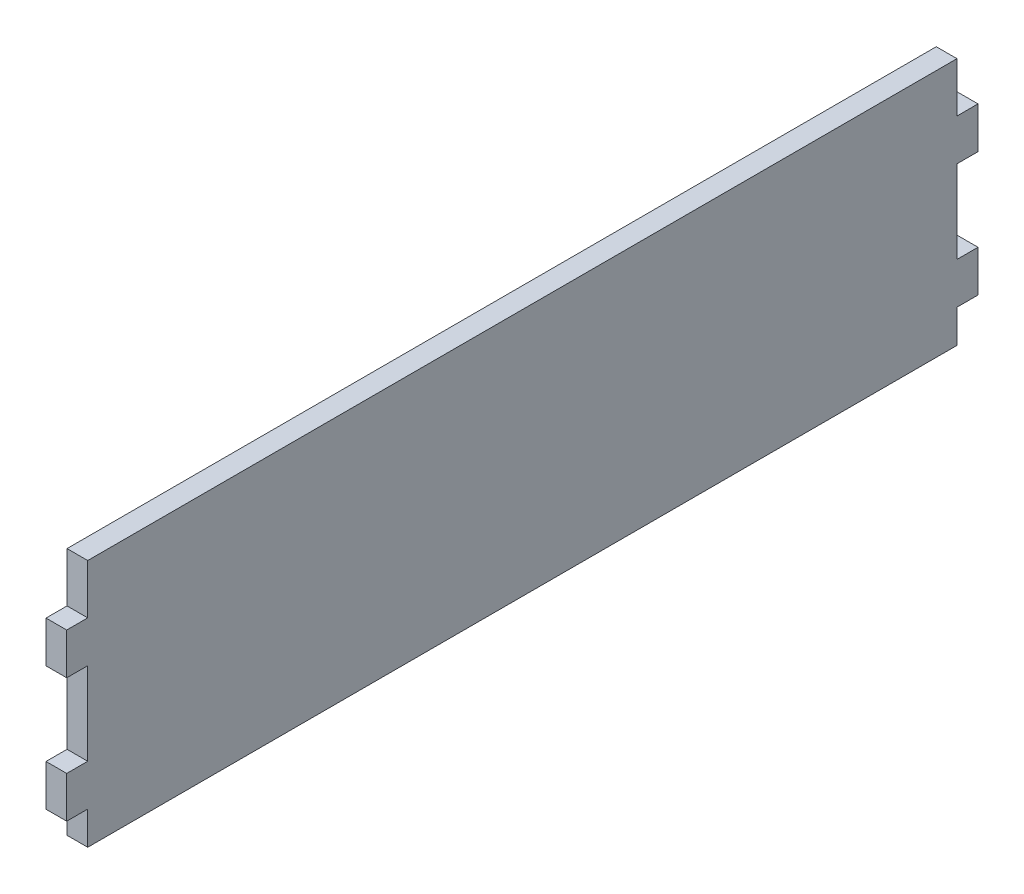
ISO-10303-21;
HEADER;
FILE_DESCRIPTION(('STEP AP214'),'2;1');
FILE_NAME('part.step','',(''),(''),'','','');
FILE_SCHEMA(('AUTOMOTIVE_DESIGN { 1 0 10303 214 1 1 1 1 }'));
ENDSEC;
DATA;
#1=APPLICATION_CONTEXT('core data for automotive mechanical design processes');
#2=APPLICATION_PROTOCOL_DEFINITION('international standard','automotive_design',2000,#1);
#3=PRODUCT_CONTEXT('',#1,'mechanical');
#4=PRODUCT('Part','Part','',(#3));
#5=PRODUCT_RELATED_PRODUCT_CATEGORY('part','',(#4));
#6=PRODUCT_DEFINITION_FORMATION('','',#4);
#7=PRODUCT_DEFINITION_CONTEXT('part definition',#1,'design');
#8=PRODUCT_DEFINITION('design','',#6,#7);
#9=PRODUCT_DEFINITION_SHAPE('','',#8);
#10=(LENGTH_UNIT() NAMED_UNIT(*) SI_UNIT(.MILLI.,.METRE.));
#11=(NAMED_UNIT(*) PLANE_ANGLE_UNIT() SI_UNIT($,.RADIAN.));
#12=(NAMED_UNIT(*) SI_UNIT($,.STERADIAN.) SOLID_ANGLE_UNIT());
#13=UNCERTAINTY_MEASURE_WITH_UNIT(LENGTH_MEASURE(1.E-05),#10,'distance_accuracy_value','');
#14=(GEOMETRIC_REPRESENTATION_CONTEXT(3) GLOBAL_UNCERTAINTY_ASSIGNED_CONTEXT((#13)) GLOBAL_UNIT_ASSIGNED_CONTEXT((#10,
#11,#12)) REPRESENTATION_CONTEXT('',''));
#15=CARTESIAN_POINT('',(0.,0.,0.));
#16=DIRECTION('',(0.,0.,1.));
#17=DIRECTION('',(1.,0.,0.));
#18=AXIS2_PLACEMENT_3D('',#15,#16,#17);
#19=CARTESIAN_POINT('',(3.175,-19.05,66.675));
#20=DIRECTION('',(0.,0.,-1.));
#21=DIRECTION('',(-1.,0.,0.));
#22=AXIS2_PLACEMENT_3D('',#19,#20,#21);
#23=PLANE('',#22);
#24=DIRECTION('',(-1.,0.,0.));
#25=VECTOR('',#24,1.);
#26=CARTESIAN_POINT('',(3.175,-7.62,66.675));
#27=LINE('',#26,#25);
#28=CARTESIAN_POINT('',(3.175,-7.62,66.675));
#29=VERTEX_POINT('',#28);
#30=CARTESIAN_POINT('',(0.,-7.62,66.675));
#31=VERTEX_POINT('',#30);
#32=EDGE_CURVE('E57',#29,#31,#27,.T.);
#33=ORIENTED_EDGE('',*,*,#32,.F.);
#34=DIRECTION('',(0.,-1.,0.));
#35=VECTOR('',#34,1.);
#36=CARTESIAN_POINT('',(3.175,-19.05,66.675));
#37=LINE('',#36,#35);
#38=CARTESIAN_POINT('',(3.175,5.08,66.675));
#39=VERTEX_POINT('',#38);
#40=EDGE_CURVE('E282',#39,#29,#37,.T.);
#41=ORIENTED_EDGE('',*,*,#40,.F.);
#42=DIRECTION('',(-1.,0.,0.));
#43=VECTOR('',#42,1.);
#44=CARTESIAN_POINT('',(3.175,5.08,66.675));
#45=LINE('',#44,#43);
#46=CARTESIAN_POINT('',(0.,5.07999999999999,66.675));
#47=VERTEX_POINT('',#46);
#48=EDGE_CURVE('E306',#39,#47,#45,.T.);
#49=ORIENTED_EDGE('',*,*,#48,.T.);
#50=DIRECTION('',(0.,-1.,0.));
#51=VECTOR('',#50,1.);
#52=CARTESIAN_POINT('',(0.,-19.05,66.675));
#53=LINE('',#52,#51);
#54=EDGE_CURVE('E232',#47,#31,#53,.T.);
#55=ORIENTED_EDGE('',*,*,#54,.T.);
#56=EDGE_LOOP('',(#33,#41,#49,#55));
#57=FACE_BOUND('',#56,.T.);
#58=ADVANCED_FACE('F32',(#57),#23,.F.);
#59=DIRECTION('',(-1.,0.,0.));
#60=VECTOR('',#59,1.);
#61=CARTESIAN_POINT('',(3.175,-13.97,66.675));
#62=LINE('',#61,#60);
#63=CARTESIAN_POINT('',(3.175,-13.97,66.675));
#64=VERTEX_POINT('',#63);
#65=CARTESIAN_POINT('',(0.,-13.97,66.675));
#66=VERTEX_POINT('',#65);
#67=EDGE_CURVE('E194',#64,#66,#62,.T.);
#68=ORIENTED_EDGE('',*,*,#67,.T.);
#69=CARTESIAN_POINT('',(0.,-19.05,66.675));
#70=VERTEX_POINT('',#69);
#71=EDGE_CURVE('E230',#66,#70,#53,.T.);
#72=ORIENTED_EDGE('',*,*,#71,.T.);
#73=DIRECTION('',(-1.,0.,0.));
#74=VECTOR('',#73,1.);
#75=CARTESIAN_POINT('',(3.175,-19.05,66.675));
#76=LINE('',#75,#74);
#77=CARTESIAN_POINT('',(3.175,-19.05,66.675));
#78=VERTEX_POINT('',#77);
#79=EDGE_CURVE('E297',#78,#70,#76,.T.);
#80=ORIENTED_EDGE('',*,*,#79,.F.);
#81=EDGE_CURVE('E36',#64,#78,#37,.T.);
#82=ORIENTED_EDGE('',*,*,#81,.F.);
#83=EDGE_LOOP('',(#68,#72,#80,#82));
#84=FACE_BOUND('',#83,.T.);
#85=ADVANCED_FACE('F426',(#84),#23,.F.);
#86=DIRECTION('',(-1.,0.,0.));
#87=VECTOR('',#86,1.);
#88=CARTESIAN_POINT('',(3.175,11.43,66.675));
#89=LINE('',#88,#87);
#90=CARTESIAN_POINT('',(3.175,11.43,66.675));
#91=VERTEX_POINT('',#90);
#92=CARTESIAN_POINT('',(0.,11.43,66.675));
#93=VERTEX_POINT('',#92);
#94=EDGE_CURVE('E221',#91,#93,#89,.T.);
#95=ORIENTED_EDGE('',*,*,#94,.F.);
#96=CARTESIAN_POINT('',(3.175,19.05,66.675));
#97=VERTEX_POINT('',#96);
#98=EDGE_CURVE('E277',#97,#91,#37,.T.);
#99=ORIENTED_EDGE('',*,*,#98,.F.);
#100=DIRECTION('',(-1.,0.,0.));
#101=VECTOR('',#100,1.);
#102=CARTESIAN_POINT('',(3.175,19.05,66.675));
#103=LINE('',#102,#101);
#104=CARTESIAN_POINT('',(0.,19.05,66.675));
#105=VERTEX_POINT('',#104);
#106=EDGE_CURVE('E42',#97,#105,#103,.T.);
#107=ORIENTED_EDGE('',*,*,#106,.T.);
#108=EDGE_CURVE('E245',#105,#93,#53,.T.);
#109=ORIENTED_EDGE('',*,*,#108,.T.);
#110=EDGE_LOOP('',(#95,#99,#107,#109));
#111=FACE_BOUND('',#110,.T.);
#112=ADVANCED_FACE('F300',(#111),#23,.F.);
#113=CARTESIAN_POINT('',(3.175,-19.05,-66.675));
#114=DIRECTION('',(0.,0.,1.));
#115=DIRECTION('',(1.,0.,0.));
#116=AXIS2_PLACEMENT_3D('',#113,#114,#115);
#117=PLANE('',#116);
#118=DIRECTION('',(0.,1.,0.));
#119=VECTOR('',#118,1.);
#120=CARTESIAN_POINT('',(0.,-19.05,-66.675));
#121=LINE('',#120,#119);
#122=CARTESIAN_POINT('',(0.,-19.05,-66.675));
#123=VERTEX_POINT('',#122);
#124=CARTESIAN_POINT('',(0.,-13.97,-66.675));
#125=VERTEX_POINT('',#124);
#126=EDGE_CURVE('E270',#123,#125,#121,.T.);
#127=ORIENTED_EDGE('',*,*,#126,.T.);
#128=DIRECTION('',(-1.,0.,0.));
#129=VECTOR('',#128,1.);
#130=CARTESIAN_POINT('',(3.175,-13.97,-66.675));
#131=LINE('',#130,#129);
#132=CARTESIAN_POINT('',(3.175,-13.97,-66.675));
#133=VERTEX_POINT('',#132);
#134=EDGE_CURVE('E336',#133,#125,#131,.T.);
#135=ORIENTED_EDGE('',*,*,#134,.F.);
#136=DIRECTION('',(0.,1.,0.));
#137=VECTOR('',#136,1.);
#138=CARTESIAN_POINT('',(3.175,-19.05,-66.675));
#139=LINE('',#138,#137);
#140=CARTESIAN_POINT('',(3.175,-19.05,-66.675));
#141=VERTEX_POINT('',#140);
#142=EDGE_CURVE('E251',#141,#133,#139,.T.);
#143=ORIENTED_EDGE('',*,*,#142,.F.);
#144=DIRECTION('',(-1.,0.,0.));
#145=VECTOR('',#144,1.);
#146=CARTESIAN_POINT('',(3.175,-19.05,-66.675));
#147=LINE('',#146,#145);
#148=EDGE_CURVE('E276',#141,#123,#147,.T.);
#149=ORIENTED_EDGE('',*,*,#148,.T.);
#150=EDGE_LOOP('',(#127,#135,#143,#149));
#151=FACE_BOUND('',#150,.T.);
#152=ADVANCED_FACE('F396',(#151),#117,.F.);
#153=CARTESIAN_POINT('',(3.175,-7.62,-66.675));
#154=VERTEX_POINT('',#153);
#155=CARTESIAN_POINT('',(3.175,5.08,-66.675));
#156=VERTEX_POINT('',#155);
#157=EDGE_CURVE('E248',#154,#156,#139,.T.);
#158=ORIENTED_EDGE('',*,*,#157,.F.);
#159=DIRECTION('',(-1.,0.,0.));
#160=VECTOR('',#159,1.);
#161=CARTESIAN_POINT('',(3.175,-7.62,-66.675));
#162=LINE('',#161,#160);
#163=CARTESIAN_POINT('',(0.,-7.62,-66.675));
#164=VERTEX_POINT('',#163);
#165=EDGE_CURVE('E328',#154,#164,#162,.T.);
#166=ORIENTED_EDGE('',*,*,#165,.T.);
#167=CARTESIAN_POINT('',(0.,5.08,-66.675));
#168=VERTEX_POINT('',#167);
#169=EDGE_CURVE('E253',#164,#168,#121,.T.);
#170=ORIENTED_EDGE('',*,*,#169,.T.);
#171=DIRECTION('',(-1.,0.,0.));
#172=VECTOR('',#171,1.);
#173=CARTESIAN_POINT('',(3.175,5.08,-66.675));
#174=LINE('',#173,#172);
#175=EDGE_CURVE('E269',#156,#168,#174,.T.);
#176=ORIENTED_EDGE('',*,*,#175,.F.);
#177=EDGE_LOOP('',(#158,#166,#170,#176));
#178=FACE_BOUND('',#177,.T.);
#179=ADVANCED_FACE('F400',(#178),#117,.F.);
#180=CARTESIAN_POINT('',(3.175,11.43,-66.675));
#181=VERTEX_POINT('',#180);
#182=CARTESIAN_POINT('',(3.175,19.05,-66.675));
#183=VERTEX_POINT('',#182);
#184=EDGE_CURVE('E252',#181,#183,#139,.T.);
#185=ORIENTED_EDGE('',*,*,#184,.F.);
#186=DIRECTION('',(-1.,0.,0.));
#187=VECTOR('',#186,1.);
#188=CARTESIAN_POINT('',(3.175,11.43,-66.675));
#189=LINE('',#188,#187);
#190=CARTESIAN_POINT('',(0.,11.43,-66.675));
#191=VERTEX_POINT('',#190);
#192=EDGE_CURVE('E366',#181,#191,#189,.T.);
#193=ORIENTED_EDGE('',*,*,#192,.T.);
#194=CARTESIAN_POINT('',(0.,19.05,-66.675));
#195=VERTEX_POINT('',#194);
#196=EDGE_CURVE('E267',#191,#195,#121,.T.);
#197=ORIENTED_EDGE('',*,*,#196,.T.);
#198=DIRECTION('',(-1.,0.,0.));
#199=VECTOR('',#198,1.);
#200=CARTESIAN_POINT('',(3.175,19.05,-66.675));
#201=LINE('',#200,#199);
#202=EDGE_CURVE('E11',#183,#195,#201,.T.);
#203=ORIENTED_EDGE('',*,*,#202,.F.);
#204=EDGE_LOOP('',(#185,#193,#197,#203));
#205=FACE_BOUND('',#204,.T.);
#206=ADVANCED_FACE('F34',(#205),#117,.F.);
#207=CARTESIAN_POINT('',(3.175,19.05,66.675));
#208=DIRECTION('',(0.,-1.,0.));
#209=DIRECTION('',(0.,0.,-1.));
#210=AXIS2_PLACEMENT_3D('',#207,#208,#209);
#211=PLANE('',#210);
#212=DIRECTION('',(0.,0.,1.));
#213=VECTOR('',#212,1.);
#214=CARTESIAN_POINT('',(0.,19.05,66.675));
#215=LINE('',#214,#213);
#216=EDGE_CURVE('E233',#195,#105,#215,.T.);
#217=ORIENTED_EDGE('',*,*,#216,.T.);
#218=ORIENTED_EDGE('',*,*,#106,.F.);
#219=DIRECTION('',(0.,0.,1.));
#220=VECTOR('',#219,1.);
#221=CARTESIAN_POINT('',(3.175,19.05,66.675));
#222=LINE('',#221,#220);
#223=EDGE_CURVE('E260',#183,#97,#222,.T.);
#224=ORIENTED_EDGE('',*,*,#223,.F.);
#225=ORIENTED_EDGE('',*,*,#202,.T.);
#226=EDGE_LOOP('',(#217,#218,#224,#225));
#227=FACE_BOUND('',#226,.T.);
#228=ADVANCED_FACE('F293',(#227),#211,.F.);
#229=CARTESIAN_POINT('',(3.175,-19.05,66.675));
#230=DIRECTION('',(0.,1.,0.));
#231=DIRECTION('',(0.,0.,1.));
#232=AXIS2_PLACEMENT_3D('',#229,#230,#231);
#233=PLANE('',#232);
#234=DIRECTION('',(0.,0.,-1.));
#235=VECTOR('',#234,1.);
#236=CARTESIAN_POINT('',(0.,-19.05,66.675));
#237=LINE('',#236,#235);
#238=EDGE_CURVE('E238',#70,#123,#237,.T.);
#239=ORIENTED_EDGE('',*,*,#238,.T.);
#240=ORIENTED_EDGE('',*,*,#148,.F.);
#241=DIRECTION('',(0.,0.,-1.));
#242=VECTOR('',#241,1.);
#243=CARTESIAN_POINT('',(3.175,-19.05,66.675));
#244=LINE('',#243,#242);
#245=EDGE_CURVE('E273',#78,#141,#244,.T.);
#246=ORIENTED_EDGE('',*,*,#245,.F.);
#247=ORIENTED_EDGE('',*,*,#79,.T.);
#248=EDGE_LOOP('',(#239,#240,#246,#247));
#249=FACE_BOUND('',#248,.T.);
#250=ADVANCED_FACE('F392',(#249),#233,.F.);
#251=CARTESIAN_POINT('',(3.175,19.05,-66.675));
#252=DIRECTION('',(-1.,0.,0.));
#253=DIRECTION('',(0.,0.,1.));
#254=AXIS2_PLACEMENT_3D('',#251,#252,#253);
#255=PLANE('',#254);
#256=ORIENTED_EDGE('',*,*,#142,.T.);
#257=DIRECTION('',(0.,0.,1.));
#258=VECTOR('',#257,1.);
#259=CARTESIAN_POINT('',(3.175,-13.97,-69.9008));
#260=LINE('',#259,#258);
#261=CARTESIAN_POINT('',(3.175,-13.97,-69.9008));
#262=VERTEX_POINT('',#261);
#263=EDGE_CURVE('E325',#262,#133,#260,.T.);
#264=ORIENTED_EDGE('',*,*,#263,.F.);
#265=DIRECTION('',(0.,-1.,0.));
#266=VECTOR('',#265,1.);
#267=CARTESIAN_POINT('',(3.175,-7.62,-69.9008));
#268=LINE('',#267,#266);
#269=CARTESIAN_POINT('',(3.175,-7.62,-69.9008));
#270=VERTEX_POINT('',#269);
#271=EDGE_CURVE('E321',#270,#262,#268,.T.);
#272=ORIENTED_EDGE('',*,*,#271,.F.);
#273=DIRECTION('',(0.,0.,-1.));
#274=VECTOR('',#273,1.);
#275=CARTESIAN_POINT('',(3.175,-7.62,-66.675));
#276=LINE('',#275,#274);
#277=EDGE_CURVE('E318',#154,#270,#276,.T.);
#278=ORIENTED_EDGE('',*,*,#277,.F.);
#279=ORIENTED_EDGE('',*,*,#157,.T.);
#280=DIRECTION('',(0.,0.,1.));
#281=VECTOR('',#280,1.);
#282=CARTESIAN_POINT('',(3.175,5.08,-69.9008));
#283=LINE('',#282,#281);
#284=CARTESIAN_POINT('',(3.175,5.08,-69.9008));
#285=VERTEX_POINT('',#284);
#286=EDGE_CURVE('E349',#285,#156,#283,.T.);
#287=ORIENTED_EDGE('',*,*,#286,.F.);
#288=DIRECTION('',(0.,-1.,0.));
#289=VECTOR('',#288,1.);
#290=CARTESIAN_POINT('',(3.175,11.43,-69.9008));
#291=LINE('',#290,#289);
#292=CARTESIAN_POINT('',(3.175,11.43,-69.9008));
#293=VERTEX_POINT('',#292);
#294=EDGE_CURVE('E346',#293,#285,#291,.T.);
#295=ORIENTED_EDGE('',*,*,#294,.F.);
#296=DIRECTION('',(0.,0.,-1.));
#297=VECTOR('',#296,1.);
#298=CARTESIAN_POINT('',(3.175,11.43,-66.675));
#299=LINE('',#298,#297);
#300=EDGE_CURVE('E350',#181,#293,#299,.T.);
#301=ORIENTED_EDGE('',*,*,#300,.F.);
#302=ORIENTED_EDGE('',*,*,#184,.T.);
#303=ORIENTED_EDGE('',*,*,#223,.T.);
#304=ORIENTED_EDGE('',*,*,#98,.T.);
#305=DIRECTION('',(0.,0.,1.));
#306=VECTOR('',#305,1.);
#307=CARTESIAN_POINT('',(3.175,11.43,66.675));
#308=LINE('',#307,#306);
#309=CARTESIAN_POINT('',(3.175,11.43,69.9008));
#310=VERTEX_POINT('',#309);
#311=EDGE_CURVE('E211',#91,#310,#308,.T.);
#312=ORIENTED_EDGE('',*,*,#311,.T.);
#313=DIRECTION('',(0.,-1.,0.));
#314=VECTOR('',#313,1.);
#315=CARTESIAN_POINT('',(3.175,11.43,69.9008));
#316=LINE('',#315,#314);
#317=CARTESIAN_POINT('',(3.175,5.08,69.9008));
#318=VERTEX_POINT('',#317);
#319=EDGE_CURVE('E209',#310,#318,#316,.T.);
#320=ORIENTED_EDGE('',*,*,#319,.T.);
#321=DIRECTION('',(0.,0.,-1.));
#322=VECTOR('',#321,1.);
#323=CARTESIAN_POINT('',(3.175,5.08,69.9008));
#324=LINE('',#323,#322);
#325=EDGE_CURVE('E212',#318,#39,#324,.T.);
#326=ORIENTED_EDGE('',*,*,#325,.T.);
#327=ORIENTED_EDGE('',*,*,#40,.T.);
#328=DIRECTION('',(0.,0.,1.));
#329=VECTOR('',#328,1.);
#330=CARTESIAN_POINT('',(3.175,-7.62,66.675));
#331=LINE('',#330,#329);
#332=CARTESIAN_POINT('',(3.175,-7.62,69.9008));
#333=VERTEX_POINT('',#332);
#334=EDGE_CURVE('E180',#29,#333,#331,.T.);
#335=ORIENTED_EDGE('',*,*,#334,.T.);
#336=DIRECTION('',(0.,-1.,0.));
#337=VECTOR('',#336,1.);
#338=CARTESIAN_POINT('',(3.175,-7.62,69.9008));
#339=LINE('',#338,#337);
#340=CARTESIAN_POINT('',(3.175,-13.97,69.9008));
#341=VERTEX_POINT('',#340);
#342=EDGE_CURVE('E172',#333,#341,#339,.T.);
#343=ORIENTED_EDGE('',*,*,#342,.T.);
#344=DIRECTION('',(0.,0.,-1.));
#345=VECTOR('',#344,1.);
#346=CARTESIAN_POINT('',(3.175,-13.97,69.9008));
#347=LINE('',#346,#345);
#348=EDGE_CURVE('E177',#341,#64,#347,.T.);
#349=ORIENTED_EDGE('',*,*,#348,.T.);
#350=ORIENTED_EDGE('',*,*,#81,.T.);
#351=ORIENTED_EDGE('',*,*,#245,.T.);
#352=EDGE_LOOP('',(#256,#264,#272,#278,#279,#287,#295,#301,#302,#303,#304,#312,#320,#326,#327,
#335,#343,#349,#350,#351));
#353=FACE_BOUND('',#352,.T.);
#354=ADVANCED_FACE('F175',(#353),#255,.F.);
#355=CARTESIAN_POINT('',(0.,19.05,-66.675));
#356=DIRECTION('',(-1.,0.,0.));
#357=DIRECTION('',(0.,0.,1.));
#358=AXIS2_PLACEMENT_3D('',#355,#356,#357);
#359=PLANE('',#358);
#360=ORIENTED_EDGE('',*,*,#126,.F.);
#361=ORIENTED_EDGE('',*,*,#238,.F.);
#362=ORIENTED_EDGE('',*,*,#71,.F.);
#363=DIRECTION('',(0.,0.,-1.));
#364=VECTOR('',#363,1.);
#365=CARTESIAN_POINT('',(0.,-13.97,69.9008));
#366=LINE('',#365,#364);
#367=CARTESIAN_POINT('',(0.,-13.97,69.9008));
#368=VERTEX_POINT('',#367);
#369=EDGE_CURVE('E202',#368,#66,#366,.T.);
#370=ORIENTED_EDGE('',*,*,#369,.F.);
#371=DIRECTION('',(0.,-1.,0.));
#372=VECTOR('',#371,1.);
#373=CARTESIAN_POINT('',(0.,-7.62,69.9008));
#374=LINE('',#373,#372);
#375=CARTESIAN_POINT('',(0.,-7.62,69.9008));
#376=VERTEX_POINT('',#375);
#377=EDGE_CURVE('E189',#376,#368,#374,.T.);
#378=ORIENTED_EDGE('',*,*,#377,.F.);
#379=DIRECTION('',(0.,0.,1.));
#380=VECTOR('',#379,1.);
#381=CARTESIAN_POINT('',(0.,-7.62,66.675));
#382=LINE('',#381,#380);
#383=EDGE_CURVE('E197',#31,#376,#382,.T.);
#384=ORIENTED_EDGE('',*,*,#383,.F.);
#385=ORIENTED_EDGE('',*,*,#54,.F.);
#386=DIRECTION('',(0.,0.,-1.));
#387=VECTOR('',#386,1.);
#388=CARTESIAN_POINT('',(0.,5.08,69.9008));
#389=LINE('',#388,#387);
#390=CARTESIAN_POINT('',(0.,5.08,69.9008));
#391=VERTEX_POINT('',#390);
#392=EDGE_CURVE('E206',#391,#47,#389,.T.);
#393=ORIENTED_EDGE('',*,*,#392,.F.);
#394=DIRECTION('',(0.,-1.,0.));
#395=VECTOR('',#394,1.);
#396=CARTESIAN_POINT('',(0.,11.43,69.9008));
#397=LINE('',#396,#395);
#398=CARTESIAN_POINT('',(0.,11.43,69.9008));
#399=VERTEX_POINT('',#398);
#400=EDGE_CURVE('E213',#399,#391,#397,.T.);
#401=ORIENTED_EDGE('',*,*,#400,.F.);
#402=DIRECTION('',(0.,0.,1.));
#403=VECTOR('',#402,1.);
#404=CARTESIAN_POINT('',(0.,11.43,66.675));
#405=LINE('',#404,#403);
#406=EDGE_CURVE('E215',#93,#399,#405,.T.);
#407=ORIENTED_EDGE('',*,*,#406,.F.);
#408=ORIENTED_EDGE('',*,*,#108,.F.);
#409=ORIENTED_EDGE('',*,*,#216,.F.);
#410=ORIENTED_EDGE('',*,*,#196,.F.);
#411=DIRECTION('',(0.,0.,-1.));
#412=VECTOR('',#411,1.);
#413=CARTESIAN_POINT('',(0.,11.43,-66.675));
#414=LINE('',#413,#412);
#415=CARTESIAN_POINT('',(0.,11.43,-69.9008));
#416=VERTEX_POINT('',#415);
#417=EDGE_CURVE('E339',#191,#416,#414,.T.);
#418=ORIENTED_EDGE('',*,*,#417,.T.);
#419=DIRECTION('',(0.,-1.,0.));
#420=VECTOR('',#419,1.);
#421=CARTESIAN_POINT('',(0.,11.43,-69.9008));
#422=LINE('',#421,#420);
#423=CARTESIAN_POINT('',(0.,5.08,-69.9008));
#424=VERTEX_POINT('',#423);
#425=EDGE_CURVE('E351',#416,#424,#422,.T.);
#426=ORIENTED_EDGE('',*,*,#425,.T.);
#427=DIRECTION('',(0.,0.,1.));
#428=VECTOR('',#427,1.);
#429=CARTESIAN_POINT('',(0.,5.08,-69.9008));
#430=LINE('',#429,#428);
#431=EDGE_CURVE('E354',#424,#168,#430,.T.);
#432=ORIENTED_EDGE('',*,*,#431,.T.);
#433=ORIENTED_EDGE('',*,*,#169,.F.);
#434=DIRECTION('',(0.,0.,-1.));
#435=VECTOR('',#434,1.);
#436=CARTESIAN_POINT('',(0.,-7.62,-66.675));
#437=LINE('',#436,#435);
#438=CARTESIAN_POINT('',(0.,-7.62,-69.9008));
#439=VERTEX_POINT('',#438);
#440=EDGE_CURVE('E225',#164,#439,#437,.T.);
#441=ORIENTED_EDGE('',*,*,#440,.T.);
#442=DIRECTION('',(0.,-1.,0.));
#443=VECTOR('',#442,1.);
#444=CARTESIAN_POINT('',(0.,-7.62,-69.9008));
#445=LINE('',#444,#443);
#446=CARTESIAN_POINT('',(0.,-13.97,-69.9008));
#447=VERTEX_POINT('',#446);
#448=EDGE_CURVE('E331',#439,#447,#445,.T.);
#449=ORIENTED_EDGE('',*,*,#448,.T.);
#450=DIRECTION('',(0.,0.,1.));
#451=VECTOR('',#450,1.);
#452=CARTESIAN_POINT('',(0.,-13.97,-69.9008));
#453=LINE('',#452,#451);
#454=EDGE_CURVE('E322',#447,#125,#453,.T.);
#455=ORIENTED_EDGE('',*,*,#454,.T.);
#456=EDGE_LOOP('',(#360,#361,#362,#370,#378,#384,#385,#393,#401,#407,#408,#409,#410,#418,#426,
#432,#433,#441,#449,#455));
#457=FACE_BOUND('',#456,.T.);
#458=ADVANCED_FACE('F383',(#457),#359,.T.);
#459=CARTESIAN_POINT('',(3.175,5.08,-69.9008));
#460=DIRECTION('',(0.,-1.,0.));
#461=DIRECTION('',(0.,0.,-1.));
#462=AXIS2_PLACEMENT_3D('',#459,#460,#461);
#463=PLANE('',#462);
#464=ORIENTED_EDGE('',*,*,#431,.F.);
#465=DIRECTION('',(-1.,0.,0.));
#466=VECTOR('',#465,1.);
#467=CARTESIAN_POINT('',(3.175,5.08,-69.9008));
#468=LINE('',#467,#466);
#469=EDGE_CURVE('E357',#285,#424,#468,.T.);
#470=ORIENTED_EDGE('',*,*,#469,.F.);
#471=ORIENTED_EDGE('',*,*,#286,.T.);
#472=ORIENTED_EDGE('',*,*,#175,.T.);
#473=EDGE_LOOP('',(#464,#470,#471,#472));
#474=FACE_BOUND('',#473,.T.);
#475=ADVANCED_FACE('F404',(#474),#463,.T.);
#476=CARTESIAN_POINT('',(3.175,11.43,-69.9008));
#477=DIRECTION('',(0.,0.,-1.));
#478=DIRECTION('',(-1.,0.,0.));
#479=AXIS2_PLACEMENT_3D('',#476,#477,#478);
#480=PLANE('',#479);
#481=ORIENTED_EDGE('',*,*,#425,.F.);
#482=DIRECTION('',(-1.,0.,0.));
#483=VECTOR('',#482,1.);
#484=CARTESIAN_POINT('',(3.175,11.43,-69.9008));
#485=LINE('',#484,#483);
#486=EDGE_CURVE('E378',#293,#416,#485,.T.);
#487=ORIENTED_EDGE('',*,*,#486,.F.);
#488=ORIENTED_EDGE('',*,*,#294,.T.);
#489=ORIENTED_EDGE('',*,*,#469,.T.);
#490=EDGE_LOOP('',(#481,#487,#488,#489));
#491=FACE_BOUND('',#490,.T.);
#492=ADVANCED_FACE('F455',(#491),#480,.T.);
#493=CARTESIAN_POINT('',(3.175,11.43,-66.675));
#494=DIRECTION('',(0.,1.,0.));
#495=DIRECTION('',(0.,0.,1.));
#496=AXIS2_PLACEMENT_3D('',#493,#494,#495);
#497=PLANE('',#496);
#498=ORIENTED_EDGE('',*,*,#417,.F.);
#499=ORIENTED_EDGE('',*,*,#192,.F.);
#500=ORIENTED_EDGE('',*,*,#300,.T.);
#501=ORIENTED_EDGE('',*,*,#486,.T.);
#502=EDGE_LOOP('',(#498,#499,#500,#501));
#503=FACE_BOUND('',#502,.T.);
#504=ADVANCED_FACE('F385',(#503),#497,.T.);
#505=CARTESIAN_POINT('',(3.175,-13.97,-69.9008));
#506=DIRECTION('',(0.,-1.,0.));
#507=DIRECTION('',(0.,0.,-1.));
#508=AXIS2_PLACEMENT_3D('',#505,#506,#507);
#509=PLANE('',#508);
#510=ORIENTED_EDGE('',*,*,#454,.F.);
#511=DIRECTION('',(-1.,0.,0.));
#512=VECTOR('',#511,1.);
#513=CARTESIAN_POINT('',(3.175,-13.97,-69.9008));
#514=LINE('',#513,#512);
#515=EDGE_CURVE('E340',#262,#447,#514,.T.);
#516=ORIENTED_EDGE('',*,*,#515,.F.);
#517=ORIENTED_EDGE('',*,*,#263,.T.);
#518=ORIENTED_EDGE('',*,*,#134,.T.);
#519=EDGE_LOOP('',(#510,#516,#517,#518));
#520=FACE_BOUND('',#519,.T.);
#521=ADVANCED_FACE('F414',(#520),#509,.T.);
#522=CARTESIAN_POINT('',(3.175,-7.62,-69.9008));
#523=DIRECTION('',(0.,0.,-1.));
#524=DIRECTION('',(-1.,0.,0.));
#525=AXIS2_PLACEMENT_3D('',#522,#523,#524);
#526=PLANE('',#525);
#527=ORIENTED_EDGE('',*,*,#448,.F.);
#528=DIRECTION('',(-1.,0.,0.));
#529=VECTOR('',#528,1.);
#530=CARTESIAN_POINT('',(3.175,-7.62,-69.9008));
#531=LINE('',#530,#529);
#532=EDGE_CURVE('E342',#270,#439,#531,.T.);
#533=ORIENTED_EDGE('',*,*,#532,.F.);
#534=ORIENTED_EDGE('',*,*,#271,.T.);
#535=ORIENTED_EDGE('',*,*,#515,.T.);
#536=EDGE_LOOP('',(#527,#533,#534,#535));
#537=FACE_BOUND('',#536,.T.);
#538=ADVANCED_FACE('F416',(#537),#526,.T.);
#539=CARTESIAN_POINT('',(3.175,-7.62,-66.675));
#540=DIRECTION('',(0.,1.,0.));
#541=DIRECTION('',(0.,0.,1.));
#542=AXIS2_PLACEMENT_3D('',#539,#540,#541);
#543=PLANE('',#542);
#544=ORIENTED_EDGE('',*,*,#440,.F.);
#545=ORIENTED_EDGE('',*,*,#165,.F.);
#546=ORIENTED_EDGE('',*,*,#277,.T.);
#547=ORIENTED_EDGE('',*,*,#532,.T.);
#548=EDGE_LOOP('',(#544,#545,#546,#547));
#549=FACE_BOUND('',#548,.T.);
#550=ADVANCED_FACE('F410',(#549),#543,.T.);
#551=CARTESIAN_POINT('',(3.175,11.43,66.675));
#552=DIRECTION('',(0.,-1.,0.));
#553=DIRECTION('',(0.,0.,-1.));
#554=AXIS2_PLACEMENT_3D('',#551,#552,#553);
#555=PLANE('',#554);
#556=ORIENTED_EDGE('',*,*,#406,.T.);
#557=DIRECTION('',(-1.,0.,0.));
#558=VECTOR('',#557,1.);
#559=CARTESIAN_POINT('',(3.175,11.43,69.9008));
#560=LINE('',#559,#558);
#561=EDGE_CURVE('E218',#310,#399,#560,.T.);
#562=ORIENTED_EDGE('',*,*,#561,.F.);
#563=ORIENTED_EDGE('',*,*,#311,.F.);
#564=ORIENTED_EDGE('',*,*,#94,.T.);
#565=EDGE_LOOP('',(#556,#562,#563,#564));
#566=FACE_BOUND('',#565,.T.);
#567=ADVANCED_FACE('F302',(#566),#555,.F.);
#568=CARTESIAN_POINT('',(3.175,11.43,69.9008));
#569=DIRECTION('',(0.,0.,-1.));
#570=DIRECTION('',(-1.,0.,0.));
#571=AXIS2_PLACEMENT_3D('',#568,#569,#570);
#572=PLANE('',#571);
#573=ORIENTED_EDGE('',*,*,#400,.T.);
#574=DIRECTION('',(-1.,0.,0.));
#575=VECTOR('',#574,1.);
#576=CARTESIAN_POINT('',(3.175,5.08,69.9008));
#577=LINE('',#576,#575);
#578=EDGE_CURVE('E308',#318,#391,#577,.T.);
#579=ORIENTED_EDGE('',*,*,#578,.F.);
#580=ORIENTED_EDGE('',*,*,#319,.F.);
#581=ORIENTED_EDGE('',*,*,#561,.T.);
#582=EDGE_LOOP('',(#573,#579,#580,#581));
#583=FACE_BOUND('',#582,.T.);
#584=ADVANCED_FACE('F521',(#583),#572,.F.);
#585=CARTESIAN_POINT('',(3.175,5.08,69.9008));
#586=DIRECTION('',(0.,1.,0.));
#587=DIRECTION('',(0.,0.,1.));
#588=AXIS2_PLACEMENT_3D('',#585,#586,#587);
#589=PLANE('',#588);
#590=ORIENTED_EDGE('',*,*,#392,.T.);
#591=ORIENTED_EDGE('',*,*,#48,.F.);
#592=ORIENTED_EDGE('',*,*,#325,.F.);
#593=ORIENTED_EDGE('',*,*,#578,.T.);
#594=EDGE_LOOP('',(#590,#591,#592,#593));
#595=FACE_BOUND('',#594,.T.);
#596=ADVANCED_FACE('F530',(#595),#589,.F.);
#597=CARTESIAN_POINT('',(3.175,-7.62,66.675));
#598=DIRECTION('',(0.,-1.,0.));
#599=DIRECTION('',(0.,0.,-1.));
#600=AXIS2_PLACEMENT_3D('',#597,#598,#599);
#601=PLANE('',#600);
#602=ORIENTED_EDGE('',*,*,#383,.T.);
#603=DIRECTION('',(-1.,0.,0.));
#604=VECTOR('',#603,1.);
#605=CARTESIAN_POINT('',(3.175,-7.62,69.9008));
#606=LINE('',#605,#604);
#607=EDGE_CURVE('E193',#333,#376,#606,.T.);
#608=ORIENTED_EDGE('',*,*,#607,.F.);
#609=ORIENTED_EDGE('',*,*,#334,.F.);
#610=ORIENTED_EDGE('',*,*,#32,.T.);
#611=EDGE_LOOP('',(#602,#608,#609,#610));
#612=FACE_BOUND('',#611,.T.);
#613=ADVANCED_FACE('F540',(#612),#601,.F.);
#614=CARTESIAN_POINT('',(3.175,-7.62,69.9008));
#615=DIRECTION('',(0.,0.,-1.));
#616=DIRECTION('',(-1.,0.,0.));
#617=AXIS2_PLACEMENT_3D('',#614,#615,#616);
#618=PLANE('',#617);
#619=ORIENTED_EDGE('',*,*,#377,.T.);
#620=DIRECTION('',(-1.,0.,0.));
#621=VECTOR('',#620,1.);
#622=CARTESIAN_POINT('',(3.175,-13.97,69.9008));
#623=LINE('',#622,#621);
#624=EDGE_CURVE('E186',#341,#368,#623,.T.);
#625=ORIENTED_EDGE('',*,*,#624,.F.);
#626=ORIENTED_EDGE('',*,*,#342,.F.);
#627=ORIENTED_EDGE('',*,*,#607,.T.);
#628=EDGE_LOOP('',(#619,#625,#626,#627));
#629=FACE_BOUND('',#628,.T.);
#630=ADVANCED_FACE('F187',(#629),#618,.F.);
#631=CARTESIAN_POINT('',(3.175,-13.97,69.9008));
#632=DIRECTION('',(0.,1.,0.));
#633=DIRECTION('',(0.,0.,1.));
#634=AXIS2_PLACEMENT_3D('',#631,#632,#633);
#635=PLANE('',#634);
#636=ORIENTED_EDGE('',*,*,#369,.T.);
#637=ORIENTED_EDGE('',*,*,#67,.F.);
#638=ORIENTED_EDGE('',*,*,#348,.F.);
#639=ORIENTED_EDGE('',*,*,#624,.T.);
#640=EDGE_LOOP('',(#636,#637,#638,#639));
#641=FACE_BOUND('',#640,.T.);
#642=ADVANCED_FACE('F196',(#641),#635,.F.);
#643=CLOSED_SHELL('',(#58,#85,#112,#152,#179,#206,#228,#250,#354,#458,#475,#492,#504,#521,#538,
#550,#567,#584,#596,#613,#630,#642));
#644=MANIFOLD_SOLID_BREP('B2',#643);
#645=ADVANCED_BREP_SHAPE_REPRESENTATION('',(#18,#644),#14);
#646=SHAPE_DEFINITION_REPRESENTATION(#9,#645);
ENDSEC;
END-ISO-10303-21;
